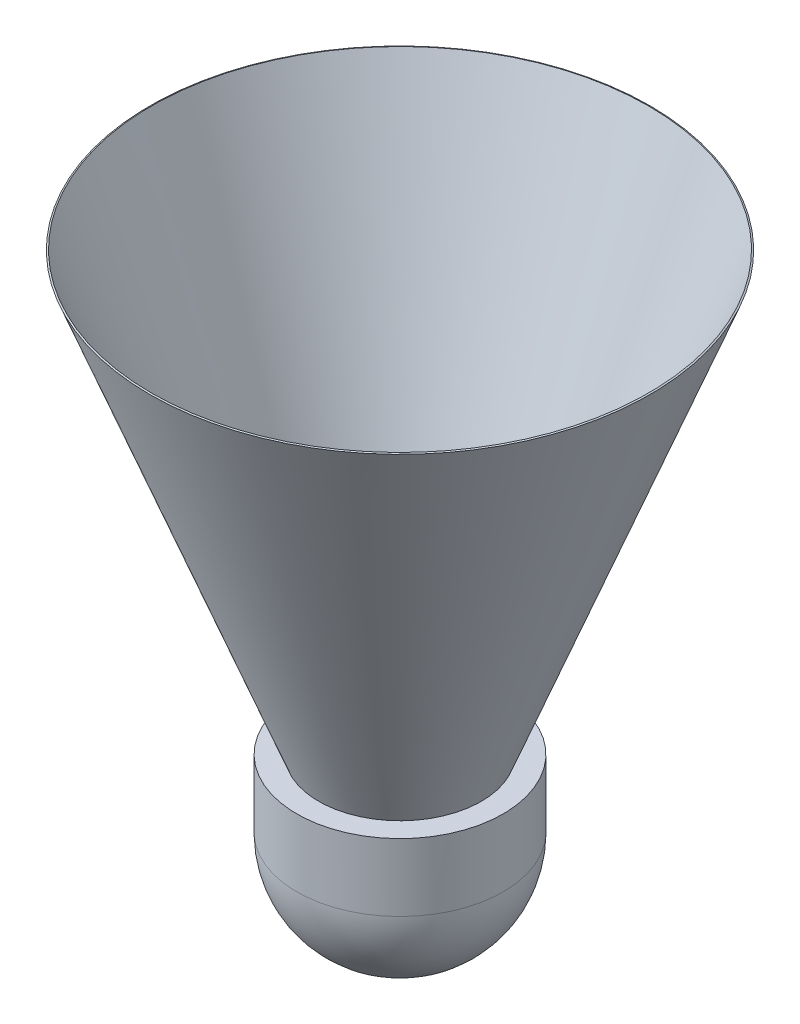
ISO-10303-21;
HEADER;
FILE_DESCRIPTION(('STEP AP214'),'2;1');
FILE_NAME('part.step','',(''),(''),'','','');
FILE_SCHEMA(('AUTOMOTIVE_DESIGN { 1 0 10303 214 1 1 1 1 }'));
ENDSEC;
DATA;
#1=APPLICATION_CONTEXT('core data for automotive mechanical design processes');
#2=APPLICATION_PROTOCOL_DEFINITION('international standard','automotive_design',2000,#1);
#3=PRODUCT_CONTEXT('',#1,'mechanical');
#4=PRODUCT('Part','Part','',(#3));
#5=PRODUCT_RELATED_PRODUCT_CATEGORY('part','',(#4));
#6=PRODUCT_DEFINITION_FORMATION('','',#4);
#7=PRODUCT_DEFINITION_CONTEXT('part definition',#1,'design');
#8=PRODUCT_DEFINITION('design','',#6,#7);
#9=PRODUCT_DEFINITION_SHAPE('','',#8);
#10=(LENGTH_UNIT() NAMED_UNIT(*) SI_UNIT(.MILLI.,.METRE.));
#11=(NAMED_UNIT(*) PLANE_ANGLE_UNIT() SI_UNIT($,.RADIAN.));
#12=(NAMED_UNIT(*) SI_UNIT($,.STERADIAN.) SOLID_ANGLE_UNIT());
#13=UNCERTAINTY_MEASURE_WITH_UNIT(LENGTH_MEASURE(1.E-05),#10,'distance_accuracy_value','');
#14=(GEOMETRIC_REPRESENTATION_CONTEXT(3) GLOBAL_UNCERTAINTY_ASSIGNED_CONTEXT((#13)) GLOBAL_UNIT_ASSIGNED_CONTEXT((#10,
#11,#12)) REPRESENTATION_CONTEXT('',''));
#15=CARTESIAN_POINT('',(0.,0.,0.));
#16=DIRECTION('',(0.,0.,1.));
#17=DIRECTION('',(1.,0.,0.));
#18=AXIS2_PLACEMENT_3D('',#15,#16,#17);
#19=CARTESIAN_POINT('',(0.,8.5,0.));
#20=DIRECTION('',(0.,1.,0.));
#21=DIRECTION('',(0.,0.,1.));
#22=AXIS2_PLACEMENT_3D('',#19,#20,#21);
#23=CONICAL_SURFACE('',#22,10.25,0.36869590265805);
#24=CARTESIAN_POINT('',(0.,63.5,0.));
#25=DIRECTION('',(0.,-1.,0.));
#26=DIRECTION('',(0.,0.,-1.));
#27=AXIS2_PLACEMENT_3D('',#24,#25,#26);
#28=CIRCLE('',#27,31.5);
#29=CARTESIAN_POINT('',(0.,63.5,-31.5));
#30=VERTEX_POINT('',#29);
#31=EDGE_CURVE('E10',#30,#30,#28,.T.);
#32=ORIENTED_EDGE('',*,*,#31,.T.);
#33=EDGE_LOOP('',(#32));
#34=FACE_BOUND('',#33,.T.);
#35=CARTESIAN_POINT('',(0.,8.5,0.));
#36=DIRECTION('',(0.,-1.,0.));
#37=DIRECTION('',(0.,0.,-1.));
#38=AXIS2_PLACEMENT_3D('',#35,#36,#37);
#39=CIRCLE('',#38,10.25);
#40=CARTESIAN_POINT('',(0.,8.5,-10.25));
#41=VERTEX_POINT('',#40);
#42=EDGE_CURVE('E54',#41,#41,#39,.T.);
#43=ORIENTED_EDGE('',*,*,#42,.F.);
#44=EDGE_LOOP('',(#43));
#45=FACE_BOUND('',#44,.T.);
#46=ADVANCED_FACE('F32',(#34,#45),#23,.T.);
#47=CARTESIAN_POINT('',(0.,63.5,0.));
#48=DIRECTION('',(0.,-1.,0.));
#49=DIRECTION('',(0.,0.,-1.));
#50=AXIS2_PLACEMENT_3D('',#47,#48,#49);
#51=CONICAL_SURFACE('',#50,31.5,1.20210042413688);
#52=CARTESIAN_POINT('',(0.,63.5720798558404,0.));
#53=DIRECTION('',(0.,-1.,0.));
#54=DIRECTION('',(0.,0.,-1.));
#55=AXIS2_PLACEMENT_3D('',#52,#53,#54);
#56=CIRCLE('',#55,31.3134403731189);
#57=CARTESIAN_POINT('',(0.,63.5720798558404,-31.3134403731189));
#58=VERTEX_POINT('',#57);
#59=EDGE_CURVE('E38',#58,#58,#56,.T.);
#60=ORIENTED_EDGE('',*,*,#59,.T.);
#61=EDGE_LOOP('',(#60));
#62=FACE_BOUND('',#61,.T.);
#63=ORIENTED_EDGE('',*,*,#31,.F.);
#64=EDGE_LOOP('',(#63));
#65=FACE_BOUND('',#64,.T.);
#66=ADVANCED_FACE('F62',(#62,#65),#51,.T.);
#67=CARTESIAN_POINT('',(0.,63.5720798558404,0.));
#68=DIRECTION('',(0.,1.,0.));
#69=DIRECTION('',(0.,0.,1.));
#70=AXIS2_PLACEMENT_3D('',#67,#68,#69);
#71=CONICAL_SURFACE('',#70,31.3134403731189,0.368695902658049);
#72=CARTESIAN_POINT('',(0.,8.5,0.));
#73=DIRECTION('',(0.,-1.,0.));
#74=DIRECTION('',(0.,0.,-1.));
#75=AXIS2_PLACEMENT_3D('',#72,#73,#74);
#76=CIRCLE('',#75,10.0355913379078);
#77=CARTESIAN_POINT('',(0.,8.5,-10.0355913379078));
#78=VERTEX_POINT('',#77);
#79=EDGE_CURVE('E42',#78,#78,#76,.T.);
#80=ORIENTED_EDGE('',*,*,#79,.T.);
#81=EDGE_LOOP('',(#80));
#82=FACE_BOUND('',#81,.T.);
#83=ORIENTED_EDGE('',*,*,#59,.F.);
#84=EDGE_LOOP('',(#83));
#85=FACE_BOUND('',#84,.T.);
#86=ADVANCED_FACE('F66',(#82,#85),#71,.F.);
#87=CARTESIAN_POINT('',(10.0355913379078,8.5,0.));
#88=DIRECTION('',(0.,1.,0.));
#89=DIRECTION('',(0.,0.,1.));
#90=AXIS2_PLACEMENT_3D('',#87,#88,#89);
#91=PLANE('',#90);
#92=ORIENTED_EDGE('',*,*,#79,.F.);
#93=EDGE_LOOP('',(#92));
#94=FACE_BOUND('',#93,.T.);
#95=ADVANCED_FACE('F70',(#94),#91,.T.);
#96=CARTESIAN_POINT('',(0.,0.,0.));
#97=DIRECTION('',(0.,-1.,0.));
#98=DIRECTION('',(-1.,0.,0.));
#99=AXIS2_PLACEMENT_3D('',#96,#97,#98);
#100=SPHERICAL_SURFACE('',#99,13.);
#101=CARTESIAN_POINT('',(0.,0.,0.));
#102=DIRECTION('',(0.,-1.,0.));
#103=DIRECTION('',(0.,0.,-1.));
#104=AXIS2_PLACEMENT_3D('',#101,#102,#103);
#105=CIRCLE('',#104,13.);
#106=CARTESIAN_POINT('',(0.,0.,-13.));
#107=VERTEX_POINT('',#106);
#108=EDGE_CURVE('E46',#107,#107,#105,.T.);
#109=ORIENTED_EDGE('',*,*,#108,.T.);
#110=EDGE_LOOP('',(#109));
#111=FACE_BOUND('',#110,.T.);
#112=ADVANCED_FACE('F77',(#111),#100,.T.);
#113=CARTESIAN_POINT('',(0.,-13.,0.));
#114=DIRECTION('',(0.,-1.,0.));
#115=DIRECTION('',(0.,0.,-1.));
#116=AXIS2_PLACEMENT_3D('',#113,#114,#115);
#117=CYLINDRICAL_SURFACE('',#116,13.);
#118=CARTESIAN_POINT('',(0.,8.5,0.));
#119=DIRECTION('',(0.,-1.,0.));
#120=DIRECTION('',(0.,0.,-1.));
#121=AXIS2_PLACEMENT_3D('',#118,#119,#120);
#122=CIRCLE('',#121,13.);
#123=CARTESIAN_POINT('',(0.,8.5,-13.));
#124=VERTEX_POINT('',#123);
#125=EDGE_CURVE('E51',#124,#124,#122,.T.);
#126=ORIENTED_EDGE('',*,*,#125,.T.);
#127=EDGE_LOOP('',(#126));
#128=FACE_BOUND('',#127,.T.);
#129=ORIENTED_EDGE('',*,*,#108,.F.);
#130=EDGE_LOOP('',(#129));
#131=FACE_BOUND('',#130,.T.);
#132=ADVANCED_FACE('F81',(#128,#131),#117,.T.);
#133=CARTESIAN_POINT('',(13.,8.5,0.));
#134=DIRECTION('',(0.,1.,0.));
#135=DIRECTION('',(0.,0.,1.));
#136=AXIS2_PLACEMENT_3D('',#133,#134,#135);
#137=PLANE('',#136);
#138=ORIENTED_EDGE('',*,*,#42,.T.);
#139=EDGE_LOOP('',(#138));
#140=FACE_BOUND('',#139,.T.);
#141=ORIENTED_EDGE('',*,*,#125,.F.);
#142=EDGE_LOOP('',(#141));
#143=FACE_BOUND('',#142,.T.);
#144=ADVANCED_FACE('F58',(#140,#143),#137,.T.);
#145=CLOSED_SHELL('',(#46,#66,#86,#95,#112,#132,#144));
#146=MANIFOLD_SOLID_BREP('B2',#145);
#147=ADVANCED_BREP_SHAPE_REPRESENTATION('',(#18,#146),#14);
#148=SHAPE_DEFINITION_REPRESENTATION(#9,#147);
ENDSEC;
END-ISO-10303-21;
